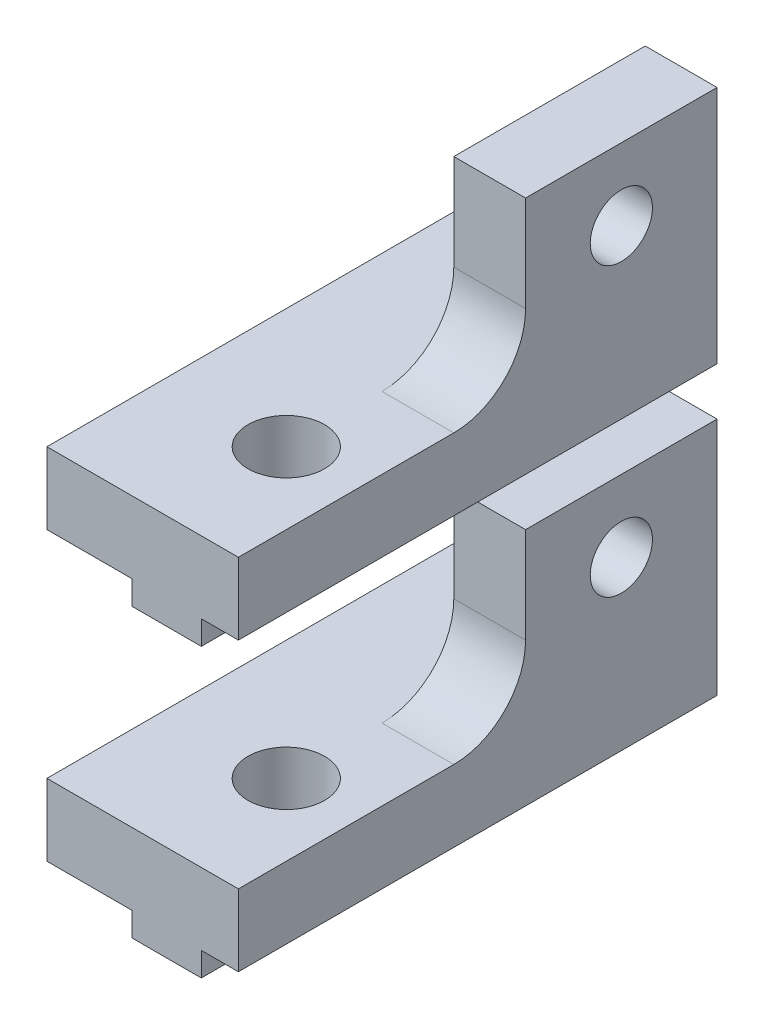
ISO-10303-21;
HEADER;
FILE_DESCRIPTION(('STEP AP214'),'2;1');
FILE_NAME('part.step','',(''),(''),'','','');
FILE_SCHEMA(('AUTOMOTIVE_DESIGN { 1 0 10303 214 1 1 1 1 }'));
ENDSEC;
DATA;
#1=APPLICATION_CONTEXT('core data for automotive mechanical design processes');
#2=APPLICATION_PROTOCOL_DEFINITION('international standard','automotive_design',2000,#1);
#3=PRODUCT_CONTEXT('',#1,'mechanical');
#4=PRODUCT('Part','Part','',(#3));
#5=PRODUCT_RELATED_PRODUCT_CATEGORY('part','',(#4));
#6=PRODUCT_DEFINITION_FORMATION('','',#4);
#7=PRODUCT_DEFINITION_CONTEXT('part definition',#1,'design');
#8=PRODUCT_DEFINITION('design','',#6,#7);
#9=PRODUCT_DEFINITION_SHAPE('','',#8);
#10=(LENGTH_UNIT() NAMED_UNIT(*) SI_UNIT(.MILLI.,.METRE.));
#11=(NAMED_UNIT(*) PLANE_ANGLE_UNIT() SI_UNIT($,.RADIAN.));
#12=(NAMED_UNIT(*) SI_UNIT($,.STERADIAN.) SOLID_ANGLE_UNIT());
#13=UNCERTAINTY_MEASURE_WITH_UNIT(LENGTH_MEASURE(1.E-05),#10,'distance_accuracy_value','');
#14=(GEOMETRIC_REPRESENTATION_CONTEXT(3) GLOBAL_UNCERTAINTY_ASSIGNED_CONTEXT((#13)) GLOBAL_UNIT_ASSIGNED_CONTEXT((#10,
#11,#12)) REPRESENTATION_CONTEXT('',''));
#15=CARTESIAN_POINT('',(0.,0.,0.));
#16=DIRECTION('',(0.,0.,1.));
#17=DIRECTION('',(1.,0.,0.));
#18=AXIS2_PLACEMENT_3D('',#15,#16,#17);
#19=CARTESIAN_POINT('',(3.55,12.,-3.06757233003559));
#20=DIRECTION('',(-1.,0.,0.));
#21=DIRECTION('',(0.,0.,1.));
#22=AXIS2_PLACEMENT_3D('',#19,#20,#21);
#23=PLANE('',#22);
#24=DIRECTION('',(0.,-1.,0.));
#25=VECTOR('',#24,1.);
#26=CARTESIAN_POINT('',(3.55,22.,14.3236125370766));
#27=LINE('',#26,#25);
#28=CARTESIAN_POINT('',(3.55,12.,14.3236125370766));
#29=VERTEX_POINT('',#28);
#30=CARTESIAN_POINT('',(3.55,11.,14.3236125370766));
#31=VERTEX_POINT('',#30);
#32=EDGE_CURVE('E161',#29,#31,#27,.T.);
#33=ORIENTED_EDGE('',*,*,#32,.F.);
#34=DIRECTION('',(0.,0.,1.));
#35=VECTOR('',#34,1.);
#36=CARTESIAN_POINT('',(3.55,12.,-3.06757233003559));
#37=LINE('',#36,#35);
#38=CARTESIAN_POINT('',(3.55,12.,0.));
#39=VERTEX_POINT('',#38);
#40=EDGE_CURVE('E284',#39,#29,#37,.T.);
#41=ORIENTED_EDGE('',*,*,#40,.F.);
#42=DIRECTION('',(0.,1.,0.));
#43=VECTOR('',#42,1.);
#44=CARTESIAN_POINT('',(3.55,12.,0.));
#45=LINE('',#44,#43);
#46=CARTESIAN_POINT('',(3.55,11.,0.));
#47=VERTEX_POINT('',#46);
#48=EDGE_CURVE('E191',#47,#39,#45,.T.);
#49=ORIENTED_EDGE('',*,*,#48,.F.);
#50=DIRECTION('',(0.,0.,1.));
#51=VECTOR('',#50,1.);
#52=CARTESIAN_POINT('',(3.55,11.,-3.06757233003559));
#53=LINE('',#52,#51);
#54=EDGE_CURVE('E184',#47,#31,#53,.T.);
#55=ORIENTED_EDGE('',*,*,#54,.T.);
#56=EDGE_LOOP('',(#33,#41,#49,#55));
#57=FACE_BOUND('',#56,.T.);
#58=ADVANCED_FACE('F44',(#57),#23,.T.);
#59=CARTESIAN_POINT('',(6.45,12.,-3.06757233003559));
#60=DIRECTION('',(1.,0.,0.));
#61=DIRECTION('',(0.,0.,-1.));
#62=AXIS2_PLACEMENT_3D('',#59,#60,#61);
#63=PLANE('',#62);
#64=DIRECTION('',(0.,-1.,0.));
#65=VECTOR('',#64,1.);
#66=CARTESIAN_POINT('',(6.45,22.,15.6763874629234));
#67=LINE('',#66,#65);
#68=CARTESIAN_POINT('',(6.45,12.,15.6763874629234));
#69=VERTEX_POINT('',#68);
#70=CARTESIAN_POINT('',(6.45,11.,15.6763874629234));
#71=VERTEX_POINT('',#70);
#72=EDGE_CURVE('E260',#69,#71,#67,.T.);
#73=ORIENTED_EDGE('',*,*,#72,.F.);
#74=DIRECTION('',(0.,0.,1.));
#75=VECTOR('',#74,1.);
#76=CARTESIAN_POINT('',(6.45,12.,-3.06757233003559));
#77=LINE('',#76,#75);
#78=CARTESIAN_POINT('',(6.45,12.,20.));
#79=VERTEX_POINT('',#78);
#80=EDGE_CURVE('E180',#69,#79,#77,.T.);
#81=ORIENTED_EDGE('',*,*,#80,.T.);
#82=DIRECTION('',(0.,1.,0.));
#83=VECTOR('',#82,1.);
#84=CARTESIAN_POINT('',(6.45,12.,20.));
#85=LINE('',#84,#83);
#86=CARTESIAN_POINT('',(6.45,11.,20.));
#87=VERTEX_POINT('',#86);
#88=EDGE_CURVE('E276',#87,#79,#85,.T.);
#89=ORIENTED_EDGE('',*,*,#88,.F.);
#90=DIRECTION('',(0.,0.,1.));
#91=VECTOR('',#90,1.);
#92=CARTESIAN_POINT('',(6.45,11.,-3.06757233003559));
#93=LINE('',#92,#91);
#94=EDGE_CURVE('E181',#71,#87,#93,.T.);
#95=ORIENTED_EDGE('',*,*,#94,.F.);
#96=EDGE_LOOP('',(#73,#81,#89,#95));
#97=FACE_BOUND('',#96,.T.);
#98=ADVANCED_FACE('F310',(#97),#63,.T.);
#99=CARTESIAN_POINT('',(3.55,11.,-3.06757233003559));
#100=DIRECTION('',(0.,-1.,0.));
#101=DIRECTION('',(0.,0.,-1.));
#102=AXIS2_PLACEMENT_3D('',#99,#100,#101);
#103=PLANE('',#102);
#104=CARTESIAN_POINT('',(5.,11.,15.));
#105=DIRECTION('',(0.,-1.,0.));
#106=DIRECTION('',(0.,0.,-1.));
#107=AXIS2_PLACEMENT_3D('',#104,#105,#106);
#108=CIRCLE('',#107,1.6);
#109=CARTESIAN_POINT('',(3.55,11.,15.6763874629234));
#110=VERTEX_POINT('',#109);
#111=EDGE_CURVE('E166',#71,#110,#108,.T.);
#112=ORIENTED_EDGE('',*,*,#111,.F.);
#113=ORIENTED_EDGE('',*,*,#94,.T.);
#114=DIRECTION('',(1.,0.,0.));
#115=VECTOR('',#114,1.);
#116=CARTESIAN_POINT('',(3.55,11.,20.));
#117=LINE('',#116,#115);
#118=CARTESIAN_POINT('',(3.55,11.,20.));
#119=VERTEX_POINT('',#118);
#120=EDGE_CURVE('E274',#119,#87,#117,.T.);
#121=ORIENTED_EDGE('',*,*,#120,.F.);
#122=EDGE_CURVE('E188',#110,#119,#53,.T.);
#123=ORIENTED_EDGE('',*,*,#122,.F.);
#124=EDGE_LOOP('',(#112,#113,#121,#123));
#125=FACE_BOUND('',#124,.T.);
#126=ADVANCED_FACE('F272',(#125),#103,.T.);
#127=CARTESIAN_POINT('',(0.,12.,20.));
#128=DIRECTION('',(0.,1.,0.));
#129=DIRECTION('',(0.,0.,1.));
#130=AXIS2_PLACEMENT_3D('',#127,#128,#129);
#131=PLANE('',#130);
#132=ORIENTED_EDGE('',*,*,#80,.F.);
#133=CARTESIAN_POINT('',(5.,12.,15.));
#134=DIRECTION('',(0.,1.,0.));
#135=DIRECTION('',(0.,0.,1.));
#136=AXIS2_PLACEMENT_3D('',#133,#134,#135);
#137=CIRCLE('',#136,1.6);
#138=CARTESIAN_POINT('',(6.45,12.,14.3236125370766));
#139=VERTEX_POINT('',#138);
#140=EDGE_CURVE('E301',#69,#139,#137,.T.);
#141=ORIENTED_EDGE('',*,*,#140,.T.);
#142=CARTESIAN_POINT('',(6.45,12.,0.));
#143=VERTEX_POINT('',#142);
#144=EDGE_CURVE('E176',#143,#139,#77,.T.);
#145=ORIENTED_EDGE('',*,*,#144,.F.);
#146=DIRECTION('',(1.,0.,0.));
#147=VECTOR('',#146,1.);
#148=CARTESIAN_POINT('',(0.,12.,0.));
#149=LINE('',#148,#147);
#150=CARTESIAN_POINT('',(8.,12.,0.));
#151=VERTEX_POINT('',#150);
#152=EDGE_CURVE('E222',#143,#151,#149,.T.);
#153=ORIENTED_EDGE('',*,*,#152,.T.);
#154=DIRECTION('',(0.,0.,-1.));
#155=VECTOR('',#154,1.);
#156=CARTESIAN_POINT('',(8.,12.,20.));
#157=LINE('',#156,#155);
#158=CARTESIAN_POINT('',(8.,12.,20.));
#159=VERTEX_POINT('',#158);
#160=EDGE_CURVE('E243',#159,#151,#157,.T.);
#161=ORIENTED_EDGE('',*,*,#160,.F.);
#162=DIRECTION('',(1.,0.,0.));
#163=VECTOR('',#162,1.);
#164=CARTESIAN_POINT('',(0.,12.,20.));
#165=LINE('',#164,#163);
#166=EDGE_CURVE('E208',#79,#159,#165,.T.);
#167=ORIENTED_EDGE('',*,*,#166,.F.);
#168=EDGE_LOOP('',(#132,#141,#145,#153,#161,#167));
#169=FACE_BOUND('',#168,.T.);
#170=ADVANCED_FACE('F306',(#169),#131,.F.);
#171=CARTESIAN_POINT('',(8.,12.,20.));
#172=DIRECTION('',(-1.,0.,0.));
#173=DIRECTION('',(0.,0.,1.));
#174=AXIS2_PLACEMENT_3D('',#171,#172,#173);
#175=PLANE('',#174);
#176=CARTESIAN_POINT('',(8.,19.,4.));
#177=DIRECTION('',(-1.,0.,0.));
#178=DIRECTION('',(0.,-1.,0.));
#179=AXIS2_PLACEMENT_3D('',#176,#177,#178);
#180=CIRCLE('',#179,1.3);
#181=CARTESIAN_POINT('',(8.,17.7,4.));
#182=VERTEX_POINT('',#181);
#183=EDGE_CURVE('E201',#182,#182,#180,.T.);
#184=ORIENTED_EDGE('',*,*,#183,.T.);
#185=EDGE_LOOP('',(#184));
#186=FACE_BOUND('',#185,.T.);
#187=DIRECTION('',(0.,0.,-1.));
#188=VECTOR('',#187,1.);
#189=CARTESIAN_POINT('',(8.,15.,20.));
#190=LINE('',#189,#188);
#191=CARTESIAN_POINT('',(8.,15.,20.));
#192=VERTEX_POINT('',#191);
#193=CARTESIAN_POINT('',(8.,15.,11.));
#194=VERTEX_POINT('',#193);
#195=EDGE_CURVE('E192',#192,#194,#190,.T.);
#196=ORIENTED_EDGE('',*,*,#195,.F.);
#197=DIRECTION('',(0.,1.,0.));
#198=VECTOR('',#197,1.);
#199=CARTESIAN_POINT('',(8.,12.,20.));
#200=LINE('',#199,#198);
#201=EDGE_CURVE('E213',#159,#192,#200,.T.);
#202=ORIENTED_EDGE('',*,*,#201,.F.);
#203=ORIENTED_EDGE('',*,*,#160,.T.);
#204=DIRECTION('',(0.,1.,0.));
#205=VECTOR('',#204,1.);
#206=CARTESIAN_POINT('',(8.,12.,0.));
#207=LINE('',#206,#205);
#208=CARTESIAN_POINT('',(8.,22.,0.));
#209=VERTEX_POINT('',#208);
#210=EDGE_CURVE('E225',#151,#209,#207,.T.);
#211=ORIENTED_EDGE('',*,*,#210,.T.);
#212=DIRECTION('',(0.,0.,-1.));
#213=VECTOR('',#212,1.);
#214=CARTESIAN_POINT('',(8.,22.,20.));
#215=LINE('',#214,#213);
#216=CARTESIAN_POINT('',(8.,22.,8.));
#217=VERTEX_POINT('',#216);
#218=EDGE_CURVE('E241',#217,#209,#215,.T.);
#219=ORIENTED_EDGE('',*,*,#218,.F.);
#220=DIRECTION('',(0.,1.,0.));
#221=VECTOR('',#220,1.);
#222=CARTESIAN_POINT('',(8.,22.,8.));
#223=LINE('',#222,#221);
#224=CARTESIAN_POINT('',(8.,18.,8.));
#225=VERTEX_POINT('',#224);
#226=EDGE_CURVE('E195',#225,#217,#223,.T.);
#227=ORIENTED_EDGE('',*,*,#226,.F.);
#228=CARTESIAN_POINT('',(8.,18.,11.));
#229=DIRECTION('',(-1.,0.,0.));
#230=DIRECTION('',(0.,0.,1.));
#231=AXIS2_PLACEMENT_3D('',#228,#229,#230);
#232=CIRCLE('',#231,3.);
#233=EDGE_CURVE('E13',#225,#194,#232,.T.);
#234=ORIENTED_EDGE('',*,*,#233,.T.);
#235=EDGE_LOOP('',(#196,#202,#203,#211,#219,#227,#234));
#236=FACE_BOUND('',#235,.T.);
#237=ADVANCED_FACE('F316',(#186,#236),#175,.F.);
#238=CARTESIAN_POINT('',(5.,22.,20.));
#239=DIRECTION('',(0.,-1.,0.));
#240=DIRECTION('',(0.,0.,-1.));
#241=AXIS2_PLACEMENT_3D('',#238,#239,#240);
#242=PLANE('',#241);
#243=DIRECTION('',(-1.,0.,0.));
#244=VECTOR('',#243,1.);
#245=CARTESIAN_POINT('',(8.,22.,8.));
#246=LINE('',#245,#244);
#247=CARTESIAN_POINT('',(5.,22.,8.));
#248=VERTEX_POINT('',#247);
#249=EDGE_CURVE('E197',#217,#248,#246,.T.);
#250=ORIENTED_EDGE('',*,*,#249,.F.);
#251=ORIENTED_EDGE('',*,*,#218,.T.);
#252=DIRECTION('',(-1.,0.,0.));
#253=VECTOR('',#252,1.);
#254=CARTESIAN_POINT('',(5.,22.,0.));
#255=LINE('',#254,#253);
#256=CARTESIAN_POINT('',(5.,22.,0.));
#257=VERTEX_POINT('',#256);
#258=EDGE_CURVE('E228',#209,#257,#255,.T.);
#259=ORIENTED_EDGE('',*,*,#258,.T.);
#260=DIRECTION('',(0.,0.,-1.));
#261=VECTOR('',#260,1.);
#262=CARTESIAN_POINT('',(5.,22.,20.));
#263=LINE('',#262,#261);
#264=EDGE_CURVE('E239',#248,#257,#263,.T.);
#265=ORIENTED_EDGE('',*,*,#264,.F.);
#266=EDGE_LOOP('',(#250,#251,#259,#265));
#267=FACE_BOUND('',#266,.T.);
#268=ADVANCED_FACE('F361',(#267),#242,.F.);
#269=CARTESIAN_POINT('',(5.,15.,20.));
#270=DIRECTION('',(1.,0.,0.));
#271=DIRECTION('',(0.,0.,-1.));
#272=AXIS2_PLACEMENT_3D('',#269,#270,#271);
#273=PLANE('',#272);
#274=CARTESIAN_POINT('',(5.,19.,4.));
#275=DIRECTION('',(1.,0.,0.));
#276=DIRECTION('',(0.,0.,-1.));
#277=AXIS2_PLACEMENT_3D('',#274,#275,#276);
#278=CIRCLE('',#277,1.3);
#279=CARTESIAN_POINT('',(5.,19.,2.7));
#280=VERTEX_POINT('',#279);
#281=EDGE_CURVE('E204',#280,#280,#278,.T.);
#282=ORIENTED_EDGE('',*,*,#281,.T.);
#283=EDGE_LOOP('',(#282));
#284=FACE_BOUND('',#283,.T.);
#285=DIRECTION('',(0.,0.,-1.));
#286=VECTOR('',#285,1.);
#287=CARTESIAN_POINT('',(5.,15.,20.));
#288=LINE('',#287,#286);
#289=CARTESIAN_POINT('',(5.,15.,11.));
#290=VERTEX_POINT('',#289);
#291=CARTESIAN_POINT('',(5.,15.,0.));
#292=VERTEX_POINT('',#291);
#293=EDGE_CURVE('E237',#290,#292,#288,.T.);
#294=ORIENTED_EDGE('',*,*,#293,.F.);
#295=CARTESIAN_POINT('',(5.,18.,11.));
#296=DIRECTION('',(1.,0.,0.));
#297=DIRECTION('',(0.,0.,-1.));
#298=AXIS2_PLACEMENT_3D('',#295,#296,#297);
#299=CIRCLE('',#298,3.);
#300=CARTESIAN_POINT('',(5.,18.,8.));
#301=VERTEX_POINT('',#300);
#302=EDGE_CURVE('E52',#290,#301,#299,.T.);
#303=ORIENTED_EDGE('',*,*,#302,.T.);
#304=DIRECTION('',(0.,1.,0.));
#305=VECTOR('',#304,1.);
#306=CARTESIAN_POINT('',(5.,22.,8.));
#307=LINE('',#306,#305);
#308=EDGE_CURVE('E190',#301,#248,#307,.T.);
#309=ORIENTED_EDGE('',*,*,#308,.T.);
#310=ORIENTED_EDGE('',*,*,#264,.T.);
#311=DIRECTION('',(0.,-1.,0.));
#312=VECTOR('',#311,1.);
#313=CARTESIAN_POINT('',(5.,15.,0.));
#314=LINE('',#313,#312);
#315=EDGE_CURVE('E231',#257,#292,#314,.T.);
#316=ORIENTED_EDGE('',*,*,#315,.T.);
#317=EDGE_LOOP('',(#294,#303,#309,#310,#316));
#318=FACE_BOUND('',#317,.T.);
#319=ADVANCED_FACE('F352',(#284,#318),#273,.F.);
#320=CARTESIAN_POINT('',(0.,12.,20.));
#321=DIRECTION('',(0.,0.,1.));
#322=DIRECTION('',(1.,0.,0.));
#323=AXIS2_PLACEMENT_3D('',#320,#321,#322);
#324=PLANE('',#323);
#325=ORIENTED_EDGE('',*,*,#201,.T.);
#326=DIRECTION('',(-1.,0.,0.));
#327=VECTOR('',#326,1.);
#328=CARTESIAN_POINT('',(5.,15.,20.));
#329=LINE('',#328,#327);
#330=CARTESIAN_POINT('',(0.,15.,20.));
#331=VERTEX_POINT('',#330);
#332=EDGE_CURVE('E216',#192,#331,#329,.T.);
#333=ORIENTED_EDGE('',*,*,#332,.T.);
#334=DIRECTION('',(0.,-1.,0.));
#335=VECTOR('',#334,1.);
#336=CARTESIAN_POINT('',(0.,15.,20.));
#337=LINE('',#336,#335);
#338=CARTESIAN_POINT('',(0.,12.,20.));
#339=VERTEX_POINT('',#338);
#340=EDGE_CURVE('E205',#331,#339,#337,.T.);
#341=ORIENTED_EDGE('',*,*,#340,.T.);
#342=CARTESIAN_POINT('',(3.55,12.,20.));
#343=VERTEX_POINT('',#342);
#344=EDGE_CURVE('E210',#339,#343,#165,.T.);
#345=ORIENTED_EDGE('',*,*,#344,.T.);
#346=DIRECTION('',(0.,-1.,0.));
#347=VECTOR('',#346,1.);
#348=CARTESIAN_POINT('',(3.55,12.,20.));
#349=LINE('',#348,#347);
#350=EDGE_CURVE('E281',#343,#119,#349,.T.);
#351=ORIENTED_EDGE('',*,*,#350,.T.);
#352=ORIENTED_EDGE('',*,*,#120,.T.);
#353=ORIENTED_EDGE('',*,*,#88,.T.);
#354=ORIENTED_EDGE('',*,*,#166,.T.);
#355=EDGE_LOOP('',(#325,#333,#341,#345,#351,#352,#353,#354));
#356=FACE_BOUND('',#355,.T.);
#357=ADVANCED_FACE('F292',(#356),#324,.T.);
#358=CARTESIAN_POINT('',(0.,15.,20.));
#359=DIRECTION('',(1.,0.,0.));
#360=DIRECTION('',(0.,1.,0.));
#361=AXIS2_PLACEMENT_3D('',#358,#359,#360);
#362=PLANE('',#361);
#363=DIRECTION('',(0.,-1.,0.));
#364=VECTOR('',#363,1.);
#365=CARTESIAN_POINT('',(0.,15.,0.));
#366=LINE('',#365,#364);
#367=CARTESIAN_POINT('',(0.,15.,0.));
#368=VERTEX_POINT('',#367);
#369=CARTESIAN_POINT('',(0.,12.,0.));
#370=VERTEX_POINT('',#369);
#371=EDGE_CURVE('E219',#368,#370,#366,.T.);
#372=ORIENTED_EDGE('',*,*,#371,.T.);
#373=DIRECTION('',(0.,0.,-1.));
#374=VECTOR('',#373,1.);
#375=CARTESIAN_POINT('',(0.,12.,20.));
#376=LINE('',#375,#374);
#377=EDGE_CURVE('E167',#339,#370,#376,.T.);
#378=ORIENTED_EDGE('',*,*,#377,.F.);
#379=ORIENTED_EDGE('',*,*,#340,.F.);
#380=DIRECTION('',(0.,0.,-1.));
#381=VECTOR('',#380,1.);
#382=CARTESIAN_POINT('',(0.,15.,20.));
#383=LINE('',#382,#381);
#384=EDGE_CURVE('E218',#331,#368,#383,.T.);
#385=ORIENTED_EDGE('',*,*,#384,.T.);
#386=EDGE_LOOP('',(#372,#378,#379,#385));
#387=FACE_BOUND('',#386,.T.);
#388=ADVANCED_FACE('F351',(#387),#362,.F.);
#389=ORIENTED_EDGE('',*,*,#40,.T.);
#390=CARTESIAN_POINT('',(5.,12.,15.));
#391=DIRECTION('',(0.,1.,0.));
#392=DIRECTION('',(0.,0.,1.));
#393=AXIS2_PLACEMENT_3D('',#390,#391,#392);
#394=CIRCLE('',#393,1.6);
#395=CARTESIAN_POINT('',(3.55,12.,15.6763874629234));
#396=VERTEX_POINT('',#395);
#397=EDGE_CURVE('E291',#29,#396,#394,.T.);
#398=ORIENTED_EDGE('',*,*,#397,.T.);
#399=EDGE_CURVE('E269',#396,#343,#37,.T.);
#400=ORIENTED_EDGE('',*,*,#399,.T.);
#401=ORIENTED_EDGE('',*,*,#344,.F.);
#402=ORIENTED_EDGE('',*,*,#377,.T.);
#403=EDGE_CURVE('E223',#370,#39,#149,.T.);
#404=ORIENTED_EDGE('',*,*,#403,.T.);
#405=EDGE_LOOP('',(#389,#398,#400,#401,#402,#404));
#406=FACE_BOUND('',#405,.T.);
#407=ADVANCED_FACE('F290',(#406),#131,.F.);
#408=CARTESIAN_POINT('',(5.,15.,20.));
#409=DIRECTION('',(0.,-1.,0.));
#410=DIRECTION('',(1.,0.,0.));
#411=AXIS2_PLACEMENT_3D('',#408,#409,#410);
#412=PLANE('',#411);
#413=CARTESIAN_POINT('',(5.,15.,15.));
#414=DIRECTION('',(0.,-1.,0.));
#415=DIRECTION('',(1.,0.,0.));
#416=AXIS2_PLACEMENT_3D('',#413,#414,#415);
#417=CIRCLE('',#416,1.6);
#418=CARTESIAN_POINT('',(6.6,15.,15.));
#419=VERTEX_POINT('',#418);
#420=EDGE_CURVE('E270',#419,#419,#417,.T.);
#421=ORIENTED_EDGE('',*,*,#420,.T.);
#422=EDGE_LOOP('',(#421));
#423=FACE_BOUND('',#422,.T.);
#424=ORIENTED_EDGE('',*,*,#195,.T.);
#425=DIRECTION('',(-1.,0.,0.));
#426=VECTOR('',#425,1.);
#427=CARTESIAN_POINT('',(5.,15.,11.));
#428=LINE('',#427,#426);
#429=EDGE_CURVE('E250',#194,#290,#428,.T.);
#430=ORIENTED_EDGE('',*,*,#429,.T.);
#431=ORIENTED_EDGE('',*,*,#293,.T.);
#432=DIRECTION('',(-1.,0.,0.));
#433=VECTOR('',#432,1.);
#434=CARTESIAN_POINT('',(5.,15.,0.));
#435=LINE('',#434,#433);
#436=EDGE_CURVE('E209',#292,#368,#435,.T.);
#437=ORIENTED_EDGE('',*,*,#436,.T.);
#438=ORIENTED_EDGE('',*,*,#384,.F.);
#439=ORIENTED_EDGE('',*,*,#332,.F.);
#440=EDGE_LOOP('',(#424,#430,#431,#437,#438,#439));
#441=FACE_BOUND('',#440,.T.);
#442=ADVANCED_FACE('F319',(#423,#441),#412,.F.);
#443=CARTESIAN_POINT('',(0.,12.,0.));
#444=DIRECTION('',(0.,0.,1.));
#445=DIRECTION('',(1.,0.,0.));
#446=AXIS2_PLACEMENT_3D('',#443,#444,#445);
#447=PLANE('',#446);
#448=ORIENTED_EDGE('',*,*,#371,.F.);
#449=ORIENTED_EDGE('',*,*,#436,.F.);
#450=ORIENTED_EDGE('',*,*,#315,.F.);
#451=ORIENTED_EDGE('',*,*,#258,.F.);
#452=ORIENTED_EDGE('',*,*,#210,.F.);
#453=ORIENTED_EDGE('',*,*,#152,.F.);
#454=DIRECTION('',(0.,-1.,0.));
#455=VECTOR('',#454,1.);
#456=CARTESIAN_POINT('',(6.45,12.,0.));
#457=LINE('',#456,#455);
#458=CARTESIAN_POINT('',(6.45,11.,0.));
#459=VERTEX_POINT('',#458);
#460=EDGE_CURVE('E286',#143,#459,#457,.T.);
#461=ORIENTED_EDGE('',*,*,#460,.T.);
#462=DIRECTION('',(-1.,0.,0.));
#463=VECTOR('',#462,1.);
#464=CARTESIAN_POINT('',(3.55,11.,0.));
#465=LINE('',#464,#463);
#466=EDGE_CURVE('E179',#459,#47,#465,.T.);
#467=ORIENTED_EDGE('',*,*,#466,.T.);
#468=ORIENTED_EDGE('',*,*,#48,.T.);
#469=ORIENTED_EDGE('',*,*,#403,.F.);
#470=EDGE_LOOP('',(#448,#449,#450,#451,#452,#453,#461,#467,#468,#469));
#471=FACE_BOUND('',#470,.T.);
#472=ADVANCED_FACE('F345',(#471),#447,.F.);
#473=CARTESIAN_POINT('',(8.,19.,4.));
#474=DIRECTION('',(-1.,0.,0.));
#475=DIRECTION('',(0.,-1.,0.));
#476=AXIS2_PLACEMENT_3D('',#473,#474,#475);
#477=CYLINDRICAL_SURFACE('',#476,1.3);
#478=ORIENTED_EDGE('',*,*,#183,.F.);
#479=EDGE_LOOP('',(#478));
#480=FACE_BOUND('',#479,.T.);
#481=ORIENTED_EDGE('',*,*,#281,.F.);
#482=EDGE_LOOP('',(#481));
#483=FACE_BOUND('',#482,.T.);
#484=ADVANCED_FACE('F341',(#480,#483),#477,.F.);
#485=CARTESIAN_POINT('',(8.,22.,8.));
#486=DIRECTION('',(0.,0.,1.));
#487=DIRECTION('',(1.,0.,0.));
#488=AXIS2_PLACEMENT_3D('',#485,#486,#487);
#489=PLANE('',#488);
#490=ORIENTED_EDGE('',*,*,#308,.F.);
#491=DIRECTION('',(-1.,0.,0.));
#492=VECTOR('',#491,1.);
#493=CARTESIAN_POINT('',(8.,18.,8.));
#494=LINE('',#493,#492);
#495=EDGE_CURVE('E59',#301,#225,#494,.F.);
#496=ORIENTED_EDGE('',*,*,#495,.T.);
#497=ORIENTED_EDGE('',*,*,#226,.T.);
#498=ORIENTED_EDGE('',*,*,#249,.T.);
#499=EDGE_LOOP('',(#490,#496,#497,#498));
#500=FACE_BOUND('',#499,.T.);
#501=ADVANCED_FACE('F336',(#500),#489,.T.);
#502=DIRECTION('',(0.,-1.,0.));
#503=VECTOR('',#502,1.);
#504=CARTESIAN_POINT('',(3.55,22.,15.6763874629234));
#505=LINE('',#504,#503);
#506=EDGE_CURVE('E257',#110,#396,#505,.F.);
#507=ORIENTED_EDGE('',*,*,#506,.F.);
#508=ORIENTED_EDGE('',*,*,#122,.T.);
#509=ORIENTED_EDGE('',*,*,#350,.F.);
#510=ORIENTED_EDGE('',*,*,#399,.F.);
#511=EDGE_LOOP('',(#507,#508,#509,#510));
#512=FACE_BOUND('',#511,.T.);
#513=ADVANCED_FACE('F266',(#512),#23,.T.);
#514=DIRECTION('',(0.,-1.,0.));
#515=VECTOR('',#514,1.);
#516=CARTESIAN_POINT('',(6.45,22.,14.3236125370766));
#517=LINE('',#516,#515);
#518=CARTESIAN_POINT('',(6.45,11.,14.3236125370766));
#519=VERTEX_POINT('',#518);
#520=EDGE_CURVE('E158',#519,#139,#517,.F.);
#521=ORIENTED_EDGE('',*,*,#520,.F.);
#522=EDGE_CURVE('E174',#459,#519,#93,.T.);
#523=ORIENTED_EDGE('',*,*,#522,.F.);
#524=ORIENTED_EDGE('',*,*,#460,.F.);
#525=ORIENTED_EDGE('',*,*,#144,.T.);
#526=EDGE_LOOP('',(#521,#523,#524,#525));
#527=FACE_BOUND('',#526,.T.);
#528=ADVANCED_FACE('F172',(#527),#63,.T.);
#529=EDGE_CURVE('E154',#31,#519,#108,.T.);
#530=ORIENTED_EDGE('',*,*,#529,.F.);
#531=ORIENTED_EDGE('',*,*,#54,.F.);
#532=ORIENTED_EDGE('',*,*,#466,.F.);
#533=ORIENTED_EDGE('',*,*,#522,.T.);
#534=EDGE_LOOP('',(#530,#531,#532,#533));
#535=FACE_BOUND('',#534,.T.);
#536=ADVANCED_FACE('F178',(#535),#103,.T.);
#537=CARTESIAN_POINT('',(5.,22.,15.));
#538=DIRECTION('',(0.,-1.,0.));
#539=DIRECTION('',(1.,0.,0.));
#540=AXIS2_PLACEMENT_3D('',#537,#538,#539);
#541=CYLINDRICAL_SURFACE('',#540,1.6);
#542=ORIENTED_EDGE('',*,*,#111,.T.);
#543=ORIENTED_EDGE('',*,*,#506,.T.);
#544=ORIENTED_EDGE('',*,*,#397,.F.);
#545=ORIENTED_EDGE('',*,*,#32,.T.);
#546=ORIENTED_EDGE('',*,*,#529,.T.);
#547=ORIENTED_EDGE('',*,*,#520,.T.);
#548=ORIENTED_EDGE('',*,*,#140,.F.);
#549=ORIENTED_EDGE('',*,*,#72,.T.);
#550=EDGE_LOOP('',(#542,#543,#544,#545,#546,#547,#548,#549));
#551=FACE_BOUND('',#550,.T.);
#552=ORIENTED_EDGE('',*,*,#420,.F.);
#553=EDGE_LOOP('',(#552));
#554=FACE_BOUND('',#553,.T.);
#555=ADVANCED_FACE('F156',(#551,#554),#541,.F.);
#556=CARTESIAN_POINT('',(5.,18.,11.));
#557=DIRECTION('',(-1.,0.,0.));
#558=DIRECTION('',(0.,-1.,0.));
#559=AXIS2_PLACEMENT_3D('',#556,#557,#558);
#560=CYLINDRICAL_SURFACE('',#559,3.);
#561=ORIENTED_EDGE('',*,*,#233,.F.);
#562=ORIENTED_EDGE('',*,*,#495,.F.);
#563=ORIENTED_EDGE('',*,*,#302,.F.);
#564=ORIENTED_EDGE('',*,*,#429,.F.);
#565=EDGE_LOOP('',(#561,#562,#563,#564));
#566=FACE_BOUND('',#565,.T.);
#567=ADVANCED_FACE('F46',(#566),#560,.F.);
#568=CLOSED_SHELL('',(#58,#98,#126,#170,#237,#268,#319,#357,#388,#407,#442,#472,#484,#501,#513,
#528,#536,#555,#567));
#569=MANIFOLD_SOLID_BREP('B2',#568);
#570=CARTESIAN_POINT('',(3.55,0.,-3.06757233003559));
#571=DIRECTION('',(-1.,0.,0.));
#572=DIRECTION('',(0.,0.,1.));
#573=AXIS2_PLACEMENT_3D('',#570,#571,#572);
#574=PLANE('',#573);
#575=DIRECTION('',(0.,-1.,0.));
#576=VECTOR('',#575,1.);
#577=CARTESIAN_POINT('',(3.55,10.,14.3236125370766));
#578=LINE('',#577,#576);
#579=CARTESIAN_POINT('',(3.55,0.,14.3236125370766));
#580=VERTEX_POINT('',#579);
#581=CARTESIAN_POINT('',(3.55,-1.,14.3236125370766));
#582=VERTEX_POINT('',#581);
#583=EDGE_CURVE('E622',#580,#582,#578,.T.);
#584=ORIENTED_EDGE('',*,*,#583,.F.);
#585=DIRECTION('',(0.,0.,1.));
#586=VECTOR('',#585,1.);
#587=CARTESIAN_POINT('',(3.55,0.,-3.06757233003559));
#588=LINE('',#587,#586);
#589=CARTESIAN_POINT('',(3.55,0.,0.));
#590=VERTEX_POINT('',#589);
#591=EDGE_CURVE('E745',#590,#580,#588,.T.);
#592=ORIENTED_EDGE('',*,*,#591,.F.);
#593=DIRECTION('',(0.,1.,0.));
#594=VECTOR('',#593,1.);
#595=CARTESIAN_POINT('',(3.55,0.,0.));
#596=LINE('',#595,#594);
#597=CARTESIAN_POINT('',(3.55,-1.,0.));
#598=VERTEX_POINT('',#597);
#599=EDGE_CURVE('E652',#598,#590,#596,.T.);
#600=ORIENTED_EDGE('',*,*,#599,.F.);
#601=DIRECTION('',(0.,0.,1.));
#602=VECTOR('',#601,1.);
#603=CARTESIAN_POINT('',(3.55,-1.,-3.06757233003559));
#604=LINE('',#603,#602);
#605=EDGE_CURVE('E645',#598,#582,#604,.T.);
#606=ORIENTED_EDGE('',*,*,#605,.T.);
#607=EDGE_LOOP('',(#584,#592,#600,#606));
#608=FACE_BOUND('',#607,.T.);
#609=ADVANCED_FACE('F505',(#608),#574,.T.);
#610=CARTESIAN_POINT('',(6.45,0.,-3.06757233003559));
#611=DIRECTION('',(1.,0.,0.));
#612=DIRECTION('',(0.,0.,-1.));
#613=AXIS2_PLACEMENT_3D('',#610,#611,#612);
#614=PLANE('',#613);
#615=DIRECTION('',(0.,-1.,0.));
#616=VECTOR('',#615,1.);
#617=CARTESIAN_POINT('',(6.45,10.,15.6763874629234));
#618=LINE('',#617,#616);
#619=CARTESIAN_POINT('',(6.45,0.,15.6763874629234));
#620=VERTEX_POINT('',#619);
#621=CARTESIAN_POINT('',(6.45,-1.,15.6763874629234));
#622=VERTEX_POINT('',#621);
#623=EDGE_CURVE('E721',#620,#622,#618,.T.);
#624=ORIENTED_EDGE('',*,*,#623,.F.);
#625=DIRECTION('',(0.,0.,1.));
#626=VECTOR('',#625,1.);
#627=CARTESIAN_POINT('',(6.45,0.,-3.06757233003559));
#628=LINE('',#627,#626);
#629=CARTESIAN_POINT('',(6.45,0.,20.));
#630=VERTEX_POINT('',#629);
#631=EDGE_CURVE('E641',#620,#630,#628,.T.);
#632=ORIENTED_EDGE('',*,*,#631,.T.);
#633=DIRECTION('',(0.,1.,0.));
#634=VECTOR('',#633,1.);
#635=CARTESIAN_POINT('',(6.45,0.,20.));
#636=LINE('',#635,#634);
#637=CARTESIAN_POINT('',(6.45,-1.,20.));
#638=VERTEX_POINT('',#637);
#639=EDGE_CURVE('E737',#638,#630,#636,.T.);
#640=ORIENTED_EDGE('',*,*,#639,.F.);
#641=DIRECTION('',(0.,0.,1.));
#642=VECTOR('',#641,1.);
#643=CARTESIAN_POINT('',(6.45,-1.,-3.06757233003559));
#644=LINE('',#643,#642);
#645=EDGE_CURVE('E642',#622,#638,#644,.T.);
#646=ORIENTED_EDGE('',*,*,#645,.F.);
#647=EDGE_LOOP('',(#624,#632,#640,#646));
#648=FACE_BOUND('',#647,.T.);
#649=ADVANCED_FACE('F771',(#648),#614,.T.);
#650=CARTESIAN_POINT('',(3.55,-1.,-3.06757233003559));
#651=DIRECTION('',(0.,-1.,0.));
#652=DIRECTION('',(0.,0.,-1.));
#653=AXIS2_PLACEMENT_3D('',#650,#651,#652);
#654=PLANE('',#653);
#655=CARTESIAN_POINT('',(5.,-1.,15.));
#656=DIRECTION('',(0.,-1.,0.));
#657=DIRECTION('',(0.,0.,-1.));
#658=AXIS2_PLACEMENT_3D('',#655,#656,#657);
#659=CIRCLE('',#658,1.6);
#660=CARTESIAN_POINT('',(3.55,-1.,15.6763874629234));
#661=VERTEX_POINT('',#660);
#662=EDGE_CURVE('E627',#622,#661,#659,.T.);
#663=ORIENTED_EDGE('',*,*,#662,.F.);
#664=ORIENTED_EDGE('',*,*,#645,.T.);
#665=DIRECTION('',(1.,0.,0.));
#666=VECTOR('',#665,1.);
#667=CARTESIAN_POINT('',(3.55,-1.,20.));
#668=LINE('',#667,#666);
#669=CARTESIAN_POINT('',(3.55,-1.,20.));
#670=VERTEX_POINT('',#669);
#671=EDGE_CURVE('E735',#670,#638,#668,.T.);
#672=ORIENTED_EDGE('',*,*,#671,.F.);
#673=EDGE_CURVE('E649',#661,#670,#604,.T.);
#674=ORIENTED_EDGE('',*,*,#673,.F.);
#675=EDGE_LOOP('',(#663,#664,#672,#674));
#676=FACE_BOUND('',#675,.T.);
#677=ADVANCED_FACE('F733',(#676),#654,.T.);
#678=CARTESIAN_POINT('',(0.,0.,20.));
#679=DIRECTION('',(0.,1.,0.));
#680=DIRECTION('',(0.,0.,1.));
#681=AXIS2_PLACEMENT_3D('',#678,#679,#680);
#682=PLANE('',#681);
#683=ORIENTED_EDGE('',*,*,#631,.F.);
#684=CARTESIAN_POINT('',(5.,0.,15.));
#685=DIRECTION('',(0.,1.,0.));
#686=DIRECTION('',(0.,0.,1.));
#687=AXIS2_PLACEMENT_3D('',#684,#685,#686);
#688=CIRCLE('',#687,1.6);
#689=CARTESIAN_POINT('',(6.45,0.,14.3236125370766));
#690=VERTEX_POINT('',#689);
#691=EDGE_CURVE('E762',#620,#690,#688,.T.);
#692=ORIENTED_EDGE('',*,*,#691,.T.);
#693=CARTESIAN_POINT('',(6.45,0.,0.));
#694=VERTEX_POINT('',#693);
#695=EDGE_CURVE('E637',#694,#690,#628,.T.);
#696=ORIENTED_EDGE('',*,*,#695,.F.);
#697=DIRECTION('',(1.,0.,0.));
#698=VECTOR('',#697,1.);
#699=CARTESIAN_POINT('',(0.,0.,0.));
#700=LINE('',#699,#698);
#701=CARTESIAN_POINT('',(8.,0.,0.));
#702=VERTEX_POINT('',#701);
#703=EDGE_CURVE('E683',#694,#702,#700,.T.);
#704=ORIENTED_EDGE('',*,*,#703,.T.);
#705=DIRECTION('',(0.,0.,-1.));
#706=VECTOR('',#705,1.);
#707=CARTESIAN_POINT('',(8.,0.,20.));
#708=LINE('',#707,#706);
#709=CARTESIAN_POINT('',(8.,0.,20.));
#710=VERTEX_POINT('',#709);
#711=EDGE_CURVE('E704',#710,#702,#708,.T.);
#712=ORIENTED_EDGE('',*,*,#711,.F.);
#713=DIRECTION('',(1.,0.,0.));
#714=VECTOR('',#713,1.);
#715=CARTESIAN_POINT('',(0.,0.,20.));
#716=LINE('',#715,#714);
#717=EDGE_CURVE('E669',#630,#710,#716,.T.);
#718=ORIENTED_EDGE('',*,*,#717,.F.);
#719=EDGE_LOOP('',(#683,#692,#696,#704,#712,#718));
#720=FACE_BOUND('',#719,.T.);
#721=ADVANCED_FACE('F767',(#720),#682,.F.);
#722=CARTESIAN_POINT('',(8.,0.,20.));
#723=DIRECTION('',(-1.,0.,0.));
#724=DIRECTION('',(0.,0.,1.));
#725=AXIS2_PLACEMENT_3D('',#722,#723,#724);
#726=PLANE('',#725);
#727=CARTESIAN_POINT('',(8.,7.,4.));
#728=DIRECTION('',(-1.,0.,0.));
#729=DIRECTION('',(0.,-1.,0.));
#730=AXIS2_PLACEMENT_3D('',#727,#728,#729);
#731=CIRCLE('',#730,1.3);
#732=CARTESIAN_POINT('',(8.,5.7,4.));
#733=VERTEX_POINT('',#732);
#734=EDGE_CURVE('E662',#733,#733,#731,.T.);
#735=ORIENTED_EDGE('',*,*,#734,.T.);
#736=EDGE_LOOP('',(#735));
#737=FACE_BOUND('',#736,.T.);
#738=DIRECTION('',(0.,0.,-1.));
#739=VECTOR('',#738,1.);
#740=CARTESIAN_POINT('',(8.,3.,20.));
#741=LINE('',#740,#739);
#742=CARTESIAN_POINT('',(8.,3.,20.));
#743=VERTEX_POINT('',#742);
#744=CARTESIAN_POINT('',(8.,3.,11.));
#745=VERTEX_POINT('',#744);
#746=EDGE_CURVE('E653',#743,#745,#741,.T.);
#747=ORIENTED_EDGE('',*,*,#746,.F.);
#748=DIRECTION('',(0.,1.,0.));
#749=VECTOR('',#748,1.);
#750=CARTESIAN_POINT('',(8.,0.,20.));
#751=LINE('',#750,#749);
#752=EDGE_CURVE('E674',#710,#743,#751,.T.);
#753=ORIENTED_EDGE('',*,*,#752,.F.);
#754=ORIENTED_EDGE('',*,*,#711,.T.);
#755=DIRECTION('',(0.,1.,0.));
#756=VECTOR('',#755,1.);
#757=CARTESIAN_POINT('',(8.,0.,0.));
#758=LINE('',#757,#756);
#759=CARTESIAN_POINT('',(8.,10.,0.));
#760=VERTEX_POINT('',#759);
#761=EDGE_CURVE('E686',#702,#760,#758,.T.);
#762=ORIENTED_EDGE('',*,*,#761,.T.);
#763=DIRECTION('',(0.,0.,-1.));
#764=VECTOR('',#763,1.);
#765=CARTESIAN_POINT('',(8.,10.,20.));
#766=LINE('',#765,#764);
#767=CARTESIAN_POINT('',(8.,10.,8.));
#768=VERTEX_POINT('',#767);
#769=EDGE_CURVE('E702',#768,#760,#766,.T.);
#770=ORIENTED_EDGE('',*,*,#769,.F.);
#771=DIRECTION('',(0.,1.,0.));
#772=VECTOR('',#771,1.);
#773=CARTESIAN_POINT('',(8.,10.,8.));
#774=LINE('',#773,#772);
#775=CARTESIAN_POINT('',(8.,6.,8.));
#776=VERTEX_POINT('',#775);
#777=EDGE_CURVE('E656',#776,#768,#774,.T.);
#778=ORIENTED_EDGE('',*,*,#777,.F.);
#779=CARTESIAN_POINT('',(8.,6.,11.));
#780=DIRECTION('',(-1.,0.,0.));
#781=DIRECTION('',(0.,0.,1.));
#782=AXIS2_PLACEMENT_3D('',#779,#780,#781);
#783=CIRCLE('',#782,3.);
#784=EDGE_CURVE('E42',#776,#745,#783,.T.);
#785=ORIENTED_EDGE('',*,*,#784,.T.);
#786=EDGE_LOOP('',(#747,#753,#754,#762,#770,#778,#785));
#787=FACE_BOUND('',#786,.T.);
#788=ADVANCED_FACE('F777',(#737,#787),#726,.F.);
#789=CARTESIAN_POINT('',(5.,10.,20.));
#790=DIRECTION('',(0.,-1.,0.));
#791=DIRECTION('',(0.,0.,-1.));
#792=AXIS2_PLACEMENT_3D('',#789,#790,#791);
#793=PLANE('',#792);
#794=DIRECTION('',(-1.,0.,0.));
#795=VECTOR('',#794,1.);
#796=CARTESIAN_POINT('',(8.,10.,8.));
#797=LINE('',#796,#795);
#798=CARTESIAN_POINT('',(5.,10.,8.));
#799=VERTEX_POINT('',#798);
#800=EDGE_CURVE('E658',#768,#799,#797,.T.);
#801=ORIENTED_EDGE('',*,*,#800,.F.);
#802=ORIENTED_EDGE('',*,*,#769,.T.);
#803=DIRECTION('',(-1.,0.,0.));
#804=VECTOR('',#803,1.);
#805=CARTESIAN_POINT('',(5.,10.,0.));
#806=LINE('',#805,#804);
#807=CARTESIAN_POINT('',(5.,10.,0.));
#808=VERTEX_POINT('',#807);
#809=EDGE_CURVE('E689',#760,#808,#806,.T.);
#810=ORIENTED_EDGE('',*,*,#809,.T.);
#811=DIRECTION('',(0.,0.,-1.));
#812=VECTOR('',#811,1.);
#813=CARTESIAN_POINT('',(5.,10.,20.));
#814=LINE('',#813,#812);
#815=EDGE_CURVE('E700',#799,#808,#814,.T.);
#816=ORIENTED_EDGE('',*,*,#815,.F.);
#817=EDGE_LOOP('',(#801,#802,#810,#816));
#818=FACE_BOUND('',#817,.T.);
#819=ADVANCED_FACE('F822',(#818),#793,.F.);
#820=CARTESIAN_POINT('',(5.,3.,20.));
#821=DIRECTION('',(1.,0.,0.));
#822=DIRECTION('',(0.,0.,-1.));
#823=AXIS2_PLACEMENT_3D('',#820,#821,#822);
#824=PLANE('',#823);
#825=CARTESIAN_POINT('',(5.,7.,4.));
#826=DIRECTION('',(1.,0.,0.));
#827=DIRECTION('',(0.,0.,-1.));
#828=AXIS2_PLACEMENT_3D('',#825,#826,#827);
#829=CIRCLE('',#828,1.3);
#830=CARTESIAN_POINT('',(5.,7.,2.7));
#831=VERTEX_POINT('',#830);
#832=EDGE_CURVE('E665',#831,#831,#829,.T.);
#833=ORIENTED_EDGE('',*,*,#832,.T.);
#834=EDGE_LOOP('',(#833));
#835=FACE_BOUND('',#834,.T.);
#836=DIRECTION('',(0.,0.,-1.));
#837=VECTOR('',#836,1.);
#838=CARTESIAN_POINT('',(5.,3.,20.));
#839=LINE('',#838,#837);
#840=CARTESIAN_POINT('',(5.,3.,11.));
#841=VERTEX_POINT('',#840);
#842=CARTESIAN_POINT('',(5.,3.,0.));
#843=VERTEX_POINT('',#842);
#844=EDGE_CURVE('E698',#841,#843,#839,.T.);
#845=ORIENTED_EDGE('',*,*,#844,.F.);
#846=CARTESIAN_POINT('',(5.,6.,11.));
#847=DIRECTION('',(1.,0.,0.));
#848=DIRECTION('',(0.,0.,-1.));
#849=AXIS2_PLACEMENT_3D('',#846,#847,#848);
#850=CIRCLE('',#849,3.);
#851=CARTESIAN_POINT('',(5.,6.,8.));
#852=VERTEX_POINT('',#851);
#853=EDGE_CURVE('E513',#841,#852,#850,.T.);
#854=ORIENTED_EDGE('',*,*,#853,.T.);
#855=DIRECTION('',(0.,1.,0.));
#856=VECTOR('',#855,1.);
#857=CARTESIAN_POINT('',(5.,10.,8.));
#858=LINE('',#857,#856);
#859=EDGE_CURVE('E651',#852,#799,#858,.T.);
#860=ORIENTED_EDGE('',*,*,#859,.T.);
#861=ORIENTED_EDGE('',*,*,#815,.T.);
#862=DIRECTION('',(0.,-1.,0.));
#863=VECTOR('',#862,1.);
#864=CARTESIAN_POINT('',(5.,3.,0.));
#865=LINE('',#864,#863);
#866=EDGE_CURVE('E692',#808,#843,#865,.T.);
#867=ORIENTED_EDGE('',*,*,#866,.T.);
#868=EDGE_LOOP('',(#845,#854,#860,#861,#867));
#869=FACE_BOUND('',#868,.T.);
#870=ADVANCED_FACE('F813',(#835,#869),#824,.F.);
#871=CARTESIAN_POINT('',(0.,0.,20.));
#872=DIRECTION('',(0.,0.,1.));
#873=DIRECTION('',(1.,0.,0.));
#874=AXIS2_PLACEMENT_3D('',#871,#872,#873);
#875=PLANE('',#874);
#876=ORIENTED_EDGE('',*,*,#752,.T.);
#877=DIRECTION('',(-1.,0.,0.));
#878=VECTOR('',#877,1.);
#879=CARTESIAN_POINT('',(5.,3.,20.));
#880=LINE('',#879,#878);
#881=CARTESIAN_POINT('',(0.,3.,20.));
#882=VERTEX_POINT('',#881);
#883=EDGE_CURVE('E677',#743,#882,#880,.T.);
#884=ORIENTED_EDGE('',*,*,#883,.T.);
#885=DIRECTION('',(0.,-1.,0.));
#886=VECTOR('',#885,1.);
#887=CARTESIAN_POINT('',(0.,3.,20.));
#888=LINE('',#887,#886);
#889=CARTESIAN_POINT('',(0.,0.,20.));
#890=VERTEX_POINT('',#889);
#891=EDGE_CURVE('E666',#882,#890,#888,.T.);
#892=ORIENTED_EDGE('',*,*,#891,.T.);
#893=CARTESIAN_POINT('',(3.55,0.,20.));
#894=VERTEX_POINT('',#893);
#895=EDGE_CURVE('E671',#890,#894,#716,.T.);
#896=ORIENTED_EDGE('',*,*,#895,.T.);
#897=DIRECTION('',(0.,-1.,0.));
#898=VECTOR('',#897,1.);
#899=CARTESIAN_POINT('',(3.55,0.,20.));
#900=LINE('',#899,#898);
#901=EDGE_CURVE('E742',#894,#670,#900,.T.);
#902=ORIENTED_EDGE('',*,*,#901,.T.);
#903=ORIENTED_EDGE('',*,*,#671,.T.);
#904=ORIENTED_EDGE('',*,*,#639,.T.);
#905=ORIENTED_EDGE('',*,*,#717,.T.);
#906=EDGE_LOOP('',(#876,#884,#892,#896,#902,#903,#904,#905));
#907=FACE_BOUND('',#906,.T.);
#908=ADVANCED_FACE('F753',(#907),#875,.T.);
#909=CARTESIAN_POINT('',(0.,3.,20.));
#910=DIRECTION('',(1.,0.,0.));
#911=DIRECTION('',(0.,1.,0.));
#912=AXIS2_PLACEMENT_3D('',#909,#910,#911);
#913=PLANE('',#912);
#914=DIRECTION('',(0.,-1.,0.));
#915=VECTOR('',#914,1.);
#916=CARTESIAN_POINT('',(0.,3.,0.));
#917=LINE('',#916,#915);
#918=CARTESIAN_POINT('',(0.,3.,0.));
#919=VERTEX_POINT('',#918);
#920=CARTESIAN_POINT('',(0.,0.,0.));
#921=VERTEX_POINT('',#920);
#922=EDGE_CURVE('E680',#919,#921,#917,.T.);
#923=ORIENTED_EDGE('',*,*,#922,.T.);
#924=DIRECTION('',(0.,0.,-1.));
#925=VECTOR('',#924,1.);
#926=CARTESIAN_POINT('',(0.,0.,20.));
#927=LINE('',#926,#925);
#928=EDGE_CURVE('E628',#890,#921,#927,.T.);
#929=ORIENTED_EDGE('',*,*,#928,.F.);
#930=ORIENTED_EDGE('',*,*,#891,.F.);
#931=DIRECTION('',(0.,0.,-1.));
#932=VECTOR('',#931,1.);
#933=CARTESIAN_POINT('',(0.,3.,20.));
#934=LINE('',#933,#932);
#935=EDGE_CURVE('E679',#882,#919,#934,.T.);
#936=ORIENTED_EDGE('',*,*,#935,.T.);
#937=EDGE_LOOP('',(#923,#929,#930,#936));
#938=FACE_BOUND('',#937,.T.);
#939=ADVANCED_FACE('F812',(#938),#913,.F.);
#940=ORIENTED_EDGE('',*,*,#591,.T.);
#941=CARTESIAN_POINT('',(5.,0.,15.));
#942=DIRECTION('',(0.,1.,0.));
#943=DIRECTION('',(0.,0.,1.));
#944=AXIS2_PLACEMENT_3D('',#941,#942,#943);
#945=CIRCLE('',#944,1.6);
#946=CARTESIAN_POINT('',(3.55,0.,15.6763874629234));
#947=VERTEX_POINT('',#946);
#948=EDGE_CURVE('E752',#580,#947,#945,.T.);
#949=ORIENTED_EDGE('',*,*,#948,.T.);
#950=EDGE_CURVE('E730',#947,#894,#588,.T.);
#951=ORIENTED_EDGE('',*,*,#950,.T.);
#952=ORIENTED_EDGE('',*,*,#895,.F.);
#953=ORIENTED_EDGE('',*,*,#928,.T.);
#954=EDGE_CURVE('E684',#921,#590,#700,.T.);
#955=ORIENTED_EDGE('',*,*,#954,.T.);
#956=EDGE_LOOP('',(#940,#949,#951,#952,#953,#955));
#957=FACE_BOUND('',#956,.T.);
#958=ADVANCED_FACE('F751',(#957),#682,.F.);
#959=CARTESIAN_POINT('',(5.,3.,20.));
#960=DIRECTION('',(0.,-1.,0.));
#961=DIRECTION('',(1.,0.,0.));
#962=AXIS2_PLACEMENT_3D('',#959,#960,#961);
#963=PLANE('',#962);
#964=CARTESIAN_POINT('',(5.,3.,15.));
#965=DIRECTION('',(0.,-1.,0.));
#966=DIRECTION('',(1.,0.,0.));
#967=AXIS2_PLACEMENT_3D('',#964,#965,#966);
#968=CIRCLE('',#967,1.6);
#969=CARTESIAN_POINT('',(6.6,3.,15.));
#970=VERTEX_POINT('',#969);
#971=EDGE_CURVE('E731',#970,#970,#968,.T.);
#972=ORIENTED_EDGE('',*,*,#971,.T.);
#973=EDGE_LOOP('',(#972));
#974=FACE_BOUND('',#973,.T.);
#975=ORIENTED_EDGE('',*,*,#746,.T.);
#976=DIRECTION('',(-1.,0.,0.));
#977=VECTOR('',#976,1.);
#978=CARTESIAN_POINT('',(5.,3.,11.));
#979=LINE('',#978,#977);
#980=EDGE_CURVE('E711',#745,#841,#979,.T.);
#981=ORIENTED_EDGE('',*,*,#980,.T.);
#982=ORIENTED_EDGE('',*,*,#844,.T.);
#983=DIRECTION('',(-1.,0.,0.));
#984=VECTOR('',#983,1.);
#985=CARTESIAN_POINT('',(5.,3.,0.));
#986=LINE('',#985,#984);
#987=EDGE_CURVE('E670',#843,#919,#986,.T.);
#988=ORIENTED_EDGE('',*,*,#987,.T.);
#989=ORIENTED_EDGE('',*,*,#935,.F.);
#990=ORIENTED_EDGE('',*,*,#883,.F.);
#991=EDGE_LOOP('',(#975,#981,#982,#988,#989,#990));
#992=FACE_BOUND('',#991,.T.);
#993=ADVANCED_FACE('F780',(#974,#992),#963,.F.);
#994=CARTESIAN_POINT('',(0.,0.,0.));
#995=DIRECTION('',(0.,0.,1.));
#996=DIRECTION('',(1.,0.,0.));
#997=AXIS2_PLACEMENT_3D('',#994,#995,#996);
#998=PLANE('',#997);
#999=ORIENTED_EDGE('',*,*,#922,.F.);
#1000=ORIENTED_EDGE('',*,*,#987,.F.);
#1001=ORIENTED_EDGE('',*,*,#866,.F.);
#1002=ORIENTED_EDGE('',*,*,#809,.F.);
#1003=ORIENTED_EDGE('',*,*,#761,.F.);
#1004=ORIENTED_EDGE('',*,*,#703,.F.);
#1005=DIRECTION('',(0.,-1.,0.));
#1006=VECTOR('',#1005,1.);
#1007=CARTESIAN_POINT('',(6.45,0.,0.));
#1008=LINE('',#1007,#1006);
#1009=CARTESIAN_POINT('',(6.45,-1.,0.));
#1010=VERTEX_POINT('',#1009);
#1011=EDGE_CURVE('E747',#694,#1010,#1008,.T.);
#1012=ORIENTED_EDGE('',*,*,#1011,.T.);
#1013=DIRECTION('',(-1.,0.,0.));
#1014=VECTOR('',#1013,1.);
#1015=CARTESIAN_POINT('',(3.55,-1.,0.));
#1016=LINE('',#1015,#1014);
#1017=EDGE_CURVE('E640',#1010,#598,#1016,.T.);
#1018=ORIENTED_EDGE('',*,*,#1017,.T.);
#1019=ORIENTED_EDGE('',*,*,#599,.T.);
#1020=ORIENTED_EDGE('',*,*,#954,.F.);
#1021=EDGE_LOOP('',(#999,#1000,#1001,#1002,#1003,#1004,#1012,#1018,#1019,#1020));
#1022=FACE_BOUND('',#1021,.T.);
#1023=ADVANCED_FACE('F806',(#1022),#998,.F.);
#1024=CARTESIAN_POINT('',(8.,7.,4.));
#1025=DIRECTION('',(-1.,0.,0.));
#1026=DIRECTION('',(0.,-1.,0.));
#1027=AXIS2_PLACEMENT_3D('',#1024,#1025,#1026);
#1028=CYLINDRICAL_SURFACE('',#1027,1.3);
#1029=ORIENTED_EDGE('',*,*,#734,.F.);
#1030=EDGE_LOOP('',(#1029));
#1031=FACE_BOUND('',#1030,.T.);
#1032=ORIENTED_EDGE('',*,*,#832,.F.);
#1033=EDGE_LOOP('',(#1032));
#1034=FACE_BOUND('',#1033,.T.);
#1035=ADVANCED_FACE('F802',(#1031,#1034),#1028,.F.);
#1036=CARTESIAN_POINT('',(8.,10.,8.));
#1037=DIRECTION('',(0.,0.,1.));
#1038=DIRECTION('',(1.,0.,0.));
#1039=AXIS2_PLACEMENT_3D('',#1036,#1037,#1038);
#1040=PLANE('',#1039);
#1041=ORIENTED_EDGE('',*,*,#859,.F.);
#1042=DIRECTION('',(-1.,0.,0.));
#1043=VECTOR('',#1042,1.);
#1044=CARTESIAN_POINT('',(8.,6.,8.));
#1045=LINE('',#1044,#1043);
#1046=EDGE_CURVE('E520',#852,#776,#1045,.F.);
#1047=ORIENTED_EDGE('',*,*,#1046,.T.);
#1048=ORIENTED_EDGE('',*,*,#777,.T.);
#1049=ORIENTED_EDGE('',*,*,#800,.T.);
#1050=EDGE_LOOP('',(#1041,#1047,#1048,#1049));
#1051=FACE_BOUND('',#1050,.T.);
#1052=ADVANCED_FACE('F797',(#1051),#1040,.T.);
#1053=DIRECTION('',(0.,-1.,0.));
#1054=VECTOR('',#1053,1.);
#1055=CARTESIAN_POINT('',(3.55,10.,15.6763874629234));
#1056=LINE('',#1055,#1054);
#1057=EDGE_CURVE('E718',#661,#947,#1056,.F.);
#1058=ORIENTED_EDGE('',*,*,#1057,.F.);
#1059=ORIENTED_EDGE('',*,*,#673,.T.);
#1060=ORIENTED_EDGE('',*,*,#901,.F.);
#1061=ORIENTED_EDGE('',*,*,#950,.F.);
#1062=EDGE_LOOP('',(#1058,#1059,#1060,#1061));
#1063=FACE_BOUND('',#1062,.T.);
#1064=ADVANCED_FACE('F727',(#1063),#574,.T.);
#1065=DIRECTION('',(0.,-1.,0.));
#1066=VECTOR('',#1065,1.);
#1067=CARTESIAN_POINT('',(6.45,10.,14.3236125370766));
#1068=LINE('',#1067,#1066);
#1069=CARTESIAN_POINT('',(6.45,-1.,14.3236125370766));
#1070=VERTEX_POINT('',#1069);
#1071=EDGE_CURVE('E619',#1070,#690,#1068,.F.);
#1072=ORIENTED_EDGE('',*,*,#1071,.F.);
#1073=EDGE_CURVE('E635',#1010,#1070,#644,.T.);
#1074=ORIENTED_EDGE('',*,*,#1073,.F.);
#1075=ORIENTED_EDGE('',*,*,#1011,.F.);
#1076=ORIENTED_EDGE('',*,*,#695,.T.);
#1077=EDGE_LOOP('',(#1072,#1074,#1075,#1076));
#1078=FACE_BOUND('',#1077,.T.);
#1079=ADVANCED_FACE('F633',(#1078),#614,.T.);
#1080=EDGE_CURVE('E615',#582,#1070,#659,.T.);
#1081=ORIENTED_EDGE('',*,*,#1080,.F.);
#1082=ORIENTED_EDGE('',*,*,#605,.F.);
#1083=ORIENTED_EDGE('',*,*,#1017,.F.);
#1084=ORIENTED_EDGE('',*,*,#1073,.T.);
#1085=EDGE_LOOP('',(#1081,#1082,#1083,#1084));
#1086=FACE_BOUND('',#1085,.T.);
#1087=ADVANCED_FACE('F639',(#1086),#654,.T.);
#1088=CARTESIAN_POINT('',(5.,10.,15.));
#1089=DIRECTION('',(0.,-1.,0.));
#1090=DIRECTION('',(1.,0.,0.));
#1091=AXIS2_PLACEMENT_3D('',#1088,#1089,#1090);
#1092=CYLINDRICAL_SURFACE('',#1091,1.6);
#1093=ORIENTED_EDGE('',*,*,#662,.T.);
#1094=ORIENTED_EDGE('',*,*,#1057,.T.);
#1095=ORIENTED_EDGE('',*,*,#948,.F.);
#1096=ORIENTED_EDGE('',*,*,#583,.T.);
#1097=ORIENTED_EDGE('',*,*,#1080,.T.);
#1098=ORIENTED_EDGE('',*,*,#1071,.T.);
#1099=ORIENTED_EDGE('',*,*,#691,.F.);
#1100=ORIENTED_EDGE('',*,*,#623,.T.);
#1101=EDGE_LOOP('',(#1093,#1094,#1095,#1096,#1097,#1098,#1099,#1100));
#1102=FACE_BOUND('',#1101,.T.);
#1103=ORIENTED_EDGE('',*,*,#971,.F.);
#1104=EDGE_LOOP('',(#1103));
#1105=FACE_BOUND('',#1104,.T.);
#1106=ADVANCED_FACE('F617',(#1102,#1105),#1092,.F.);
#1107=CARTESIAN_POINT('',(5.,6.,11.));
#1108=DIRECTION('',(-1.,0.,0.));
#1109=DIRECTION('',(0.,-1.,0.));
#1110=AXIS2_PLACEMENT_3D('',#1107,#1108,#1109);
#1111=CYLINDRICAL_SURFACE('',#1110,3.);
#1112=ORIENTED_EDGE('',*,*,#784,.F.);
#1113=ORIENTED_EDGE('',*,*,#1046,.F.);
#1114=ORIENTED_EDGE('',*,*,#853,.F.);
#1115=ORIENTED_EDGE('',*,*,#980,.F.);
#1116=EDGE_LOOP('',(#1112,#1113,#1114,#1115));
#1117=FACE_BOUND('',#1116,.T.);
#1118=ADVANCED_FACE('F507',(#1117),#1111,.F.);
#1119=CLOSED_SHELL('',(#609,#649,#677,#721,#788,#819,#870,#908,#939,#958,#993,#1023,#1035,#1052,
#1064,#1079,#1087,#1106,#1118));
#1120=MANIFOLD_SOLID_BREP('B7',#1119);
#1121=ADVANCED_BREP_SHAPE_REPRESENTATION('',(#18,#569,#1120),#14);
#1122=SHAPE_DEFINITION_REPRESENTATION(#9,#1121);
ENDSEC;
END-ISO-10303-21;
